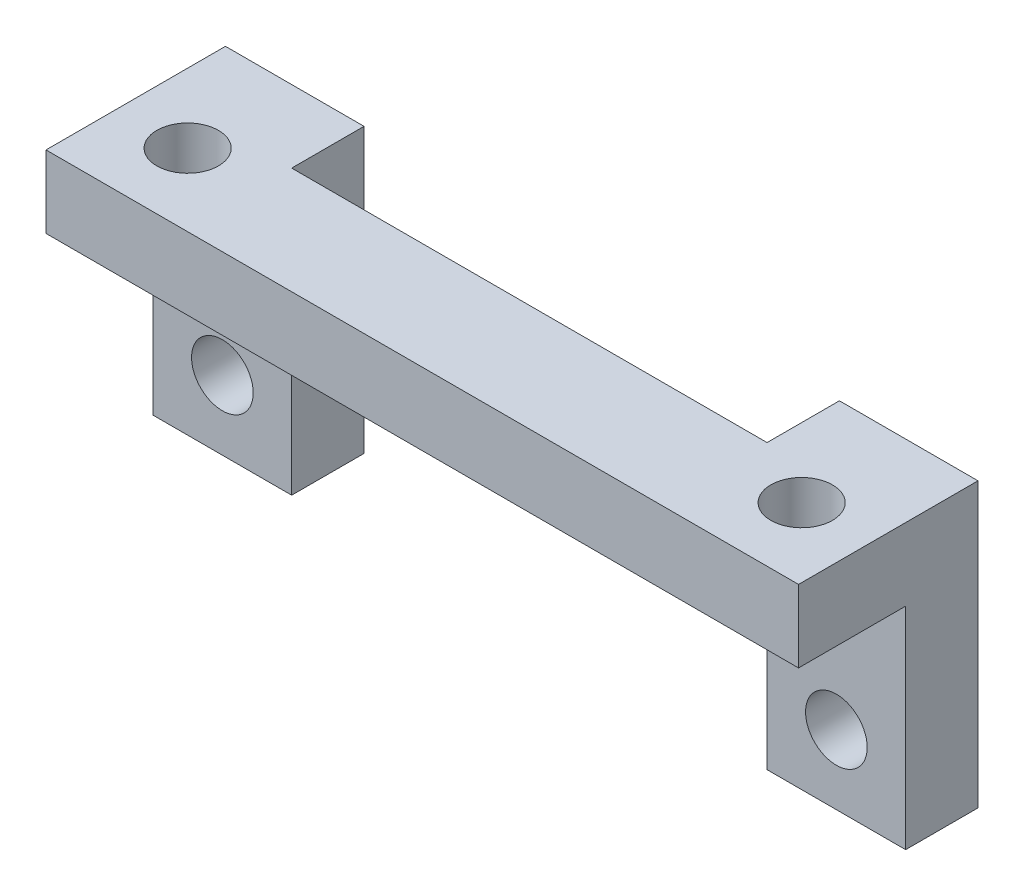
ISO-10303-21;
HEADER;
FILE_DESCRIPTION(('STEP AP214'),'2;1');
FILE_NAME('part.step','',(''),(''),'','','');
FILE_SCHEMA(('AUTOMOTIVE_DESIGN { 1 0 10303 214 1 1 1 1 }'));
ENDSEC;
DATA;
#1=APPLICATION_CONTEXT('core data for automotive mechanical design processes');
#2=APPLICATION_PROTOCOL_DEFINITION('international standard','automotive_design',2000,#1);
#3=PRODUCT_CONTEXT('',#1,'mechanical');
#4=PRODUCT('Part','Part','',(#3));
#5=PRODUCT_RELATED_PRODUCT_CATEGORY('part','',(#4));
#6=PRODUCT_DEFINITION_FORMATION('','',#4);
#7=PRODUCT_DEFINITION_CONTEXT('part definition',#1,'design');
#8=PRODUCT_DEFINITION('design','',#6,#7);
#9=PRODUCT_DEFINITION_SHAPE('','',#8);
#10=(LENGTH_UNIT() NAMED_UNIT(*) SI_UNIT(.MILLI.,.METRE.));
#11=(NAMED_UNIT(*) PLANE_ANGLE_UNIT() SI_UNIT($,.RADIAN.));
#12=(NAMED_UNIT(*) SI_UNIT($,.STERADIAN.) SOLID_ANGLE_UNIT());
#13=UNCERTAINTY_MEASURE_WITH_UNIT(LENGTH_MEASURE(1.E-05),#10,'distance_accuracy_value','');
#14=(GEOMETRIC_REPRESENTATION_CONTEXT(3) GLOBAL_UNCERTAINTY_ASSIGNED_CONTEXT((#13)) GLOBAL_UNIT_ASSIGNED_CONTEXT((#10,
#11,#12)) REPRESENTATION_CONTEXT('',''));
#15=CARTESIAN_POINT('',(0.,0.,0.));
#16=DIRECTION('',(0.,0.,1.));
#17=DIRECTION('',(1.,0.,0.));
#18=AXIS2_PLACEMENT_3D('',#15,#16,#17);
#19=CARTESIAN_POINT('',(13.4703798183963,-6.21538,-0.762000000000008));
#20=DIRECTION('',(0.,0.,1.));
#21=DIRECTION('',(1.,0.,0.));
#22=AXIS2_PLACEMENT_3D('',#19,#20,#21);
#23=CYLINDRICAL_SURFACE('',#22,1.35254999999999);
#24=CARTESIAN_POINT('',(13.4703798183963,-6.21538,-3.93700000000001));
#25=DIRECTION('',(0.,0.,1.));
#26=DIRECTION('',(1.,0.,0.));
#27=AXIS2_PLACEMENT_3D('',#24,#25,#26);
#28=CIRCLE('',#27,1.35254999999999);
#29=CARTESIAN_POINT('',(14.8229298183963,-6.21538,-3.93700000000001));
#30=VERTEX_POINT('',#29);
#31=EDGE_CURVE('E130',#30,#30,#28,.F.);
#32=ORIENTED_EDGE('',*,*,#31,.T.);
#33=EDGE_LOOP('',(#32));
#34=FACE_BOUND('',#33,.T.);
#35=CARTESIAN_POINT('',(13.4703798183963,-6.21538,-0.762000000000007));
#36=DIRECTION('',(0.,0.,1.));
#37=DIRECTION('',(1.,0.,0.));
#38=AXIS2_PLACEMENT_3D('',#35,#36,#37);
#39=CIRCLE('',#38,1.35254999999999);
#40=CARTESIAN_POINT('',(14.8229298183963,-6.21538,-0.762000000000007));
#41=VERTEX_POINT('',#40);
#42=EDGE_CURVE('E108',#41,#41,#39,.T.);
#43=ORIENTED_EDGE('',*,*,#42,.T.);
#44=EDGE_LOOP('',(#43));
#45=FACE_BOUND('',#44,.T.);
#46=ADVANCED_FACE('F17',(#34,#45),#23,.F.);
#47=CARTESIAN_POINT('',(-13.4703841816037,-6.21538,-0.762000000000008));
#48=DIRECTION('',(0.,0.,1.));
#49=DIRECTION('',(1.,0.,0.));
#50=AXIS2_PLACEMENT_3D('',#47,#48,#49);
#51=CYLINDRICAL_SURFACE('',#50,1.35254999999999);
#52=CARTESIAN_POINT('',(-13.4703841816037,-6.21538,-3.93700000000001));
#53=DIRECTION('',(0.,0.,1.));
#54=DIRECTION('',(1.,0.,0.));
#55=AXIS2_PLACEMENT_3D('',#52,#53,#54);
#56=CIRCLE('',#55,1.35254999999999);
#57=CARTESIAN_POINT('',(-12.1178341816037,-6.21538,-3.93700000000001));
#58=VERTEX_POINT('',#57);
#59=EDGE_CURVE('E145',#58,#58,#56,.F.);
#60=ORIENTED_EDGE('',*,*,#59,.T.);
#61=EDGE_LOOP('',(#60));
#62=FACE_BOUND('',#61,.T.);
#63=CARTESIAN_POINT('',(-13.4703841816037,-6.21538,-0.762000000000007));
#64=DIRECTION('',(0.,0.,1.));
#65=DIRECTION('',(1.,0.,0.));
#66=AXIS2_PLACEMENT_3D('',#63,#64,#65);
#67=CIRCLE('',#66,1.35254999999999);
#68=CARTESIAN_POINT('',(-12.1178341816037,-6.21538,-0.762000000000007));
#69=VERTEX_POINT('',#68);
#70=EDGE_CURVE('E20',#69,#69,#67,.T.);
#71=ORIENTED_EDGE('',*,*,#70,.T.);
#72=EDGE_LOOP('',(#71));
#73=FACE_BOUND('',#72,.T.);
#74=ADVANCED_FACE('F322',(#62,#73),#51,.F.);
#75=CARTESIAN_POINT('',(-10.42924,-9.25576,-0.762000000000008));
#76=DIRECTION('',(0.,0.,-1.));
#77=DIRECTION('',(-1.,0.,0.));
#78=AXIS2_PLACEMENT_3D('',#75,#76,#77);
#79=PLANE('',#78);
#80=DIRECTION('',(0.,1.,0.));
#81=VECTOR('',#80,1.);
#82=CARTESIAN_POINT('',(-16.51,3.175,-0.762000000000008));
#83=LINE('',#82,#81);
#84=CARTESIAN_POINT('',(-16.51,0.,-0.762000000000004));
#85=VERTEX_POINT('',#84);
#86=CARTESIAN_POINT('',(-16.51,-9.25576,-0.762000000000008));
#87=VERTEX_POINT('',#86);
#88=EDGE_CURVE('E356',#85,#87,#83,.F.);
#89=ORIENTED_EDGE('',*,*,#88,.T.);
#90=DIRECTION('',(1.,0.,0.));
#91=VECTOR('',#90,1.);
#92=CARTESIAN_POINT('',(0.,-9.25576,-0.762000000000008));
#93=LINE('',#92,#91);
#94=CARTESIAN_POINT('',(-10.42924,-9.25576,-0.762000000000008));
#95=VERTEX_POINT('',#94);
#96=EDGE_CURVE('E134',#95,#87,#93,.F.);
#97=ORIENTED_EDGE('',*,*,#96,.F.);
#98=DIRECTION('',(0.,1.,0.));
#99=VECTOR('',#98,1.);
#100=CARTESIAN_POINT('',(-10.42924,3.175,-0.762000000000008));
#101=LINE('',#100,#99);
#102=CARTESIAN_POINT('',(-10.42924,0.,-0.762000000000002));
#103=VERTEX_POINT('',#102);
#104=EDGE_CURVE('E381',#95,#103,#101,.T.);
#105=ORIENTED_EDGE('',*,*,#104,.T.);
#106=DIRECTION('',(1.,0.,0.));
#107=VECTOR('',#106,1.);
#108=CARTESIAN_POINT('',(0.,0.,-0.762000000000001));
#109=LINE('',#108,#107);
#110=EDGE_CURVE('E107',#103,#85,#109,.F.);
#111=ORIENTED_EDGE('',*,*,#110,.T.);
#112=EDGE_LOOP('',(#89,#97,#105,#111));
#113=FACE_BOUND('',#112,.T.);
#114=ORIENTED_EDGE('',*,*,#70,.F.);
#115=EDGE_LOOP('',(#114));
#116=FACE_BOUND('',#115,.T.);
#117=ADVANCED_FACE('F313',(#113,#116),#79,.F.);
#118=CARTESIAN_POINT('',(0.,-9.25576,0.));
#119=DIRECTION('',(0.,-1.,0.));
#120=DIRECTION('',(0.,0.,-1.));
#121=AXIS2_PLACEMENT_3D('',#118,#119,#120);
#122=PLANE('',#121);
#123=DIRECTION('',(0.,0.,-1.));
#124=VECTOR('',#123,1.);
#125=CARTESIAN_POINT('',(-16.51,-9.25576,3.937));
#126=LINE('',#125,#124);
#127=CARTESIAN_POINT('',(-16.51,-9.25576,-3.937));
#128=VERTEX_POINT('',#127);
#129=EDGE_CURVE('E361',#87,#128,#126,.T.);
#130=ORIENTED_EDGE('',*,*,#129,.T.);
#131=DIRECTION('',(1.,0.,0.));
#132=VECTOR('',#131,1.);
#133=CARTESIAN_POINT('',(-16.51,-9.25576,-3.937));
#134=LINE('',#133,#132);
#135=CARTESIAN_POINT('',(-10.42924,-9.25576,-3.937));
#136=VERTEX_POINT('',#135);
#137=EDGE_CURVE('E148',#128,#136,#134,.T.);
#138=ORIENTED_EDGE('',*,*,#137,.T.);
#139=DIRECTION('',(0.,0.,1.));
#140=VECTOR('',#139,1.);
#141=CARTESIAN_POINT('',(-10.42924,-9.25576,-3.937));
#142=LINE('',#141,#140);
#143=EDGE_CURVE('E366',#136,#95,#142,.T.);
#144=ORIENTED_EDGE('',*,*,#143,.T.);
#145=ORIENTED_EDGE('',*,*,#96,.T.);
#146=EDGE_LOOP('',(#130,#138,#144,#145));
#147=FACE_BOUND('',#146,.T.);
#148=ADVANCED_FACE('F170',(#147),#122,.T.);
#149=CARTESIAN_POINT('',(0.,-9.25576,0.));
#150=DIRECTION('',(0.,1.,0.));
#151=DIRECTION('',(0.,0.,1.));
#152=AXIS2_PLACEMENT_3D('',#149,#150,#151);
#153=PLANE('',#152);
#154=DIRECTION('',(0.,0.,-1.));
#155=VECTOR('',#154,1.);
#156=CARTESIAN_POINT('',(10.42924,-9.25576,-3.937));
#157=LINE('',#156,#155);
#158=CARTESIAN_POINT('',(10.42924,-9.25576,-0.762000000000004));
#159=VERTEX_POINT('',#158);
#160=CARTESIAN_POINT('',(10.42924,-9.25576,-3.937));
#161=VERTEX_POINT('',#160);
#162=EDGE_CURVE('E97',#159,#161,#157,.T.);
#163=ORIENTED_EDGE('',*,*,#162,.T.);
#164=DIRECTION('',(1.,0.,0.));
#165=VECTOR('',#164,1.);
#166=CARTESIAN_POINT('',(10.42924,-9.25576,-3.937));
#167=LINE('',#166,#165);
#168=CARTESIAN_POINT('',(16.51,-9.25576,-3.937));
#169=VERTEX_POINT('',#168);
#170=EDGE_CURVE('E118',#161,#169,#167,.T.);
#171=ORIENTED_EDGE('',*,*,#170,.T.);
#172=DIRECTION('',(0.,0.,1.));
#173=VECTOR('',#172,1.);
#174=CARTESIAN_POINT('',(16.51,-9.25576,3.937));
#175=LINE('',#174,#173);
#176=CARTESIAN_POINT('',(16.51,-9.25576,-0.762000000000004));
#177=VERTEX_POINT('',#176);
#178=EDGE_CURVE('E104',#169,#177,#175,.T.);
#179=ORIENTED_EDGE('',*,*,#178,.T.);
#180=DIRECTION('',(-1.,0.,0.));
#181=VECTOR('',#180,1.);
#182=CARTESIAN_POINT('',(10.42924,-9.25576,-0.762000000000004));
#183=LINE('',#182,#181);
#184=EDGE_CURVE('E100',#177,#159,#183,.T.);
#185=ORIENTED_EDGE('',*,*,#184,.T.);
#186=EDGE_LOOP('',(#163,#171,#179,#185));
#187=FACE_BOUND('',#186,.T.);
#188=ADVANCED_FACE('F102',(#187),#153,.F.);
#189=CARTESIAN_POINT('',(10.42924,-9.25576,-0.762000000000004));
#190=DIRECTION('',(0.,0.,-1.));
#191=DIRECTION('',(-1.,0.,0.));
#192=AXIS2_PLACEMENT_3D('',#189,#190,#191);
#193=PLANE('',#192);
#194=DIRECTION('',(0.,1.,0.));
#195=VECTOR('',#194,1.);
#196=CARTESIAN_POINT('',(10.42924,3.175,-0.762000000000004));
#197=LINE('',#196,#195);
#198=CARTESIAN_POINT('',(10.42924,0.,-0.762000000000004));
#199=VERTEX_POINT('',#198);
#200=EDGE_CURVE('E111',#199,#159,#197,.F.);
#201=ORIENTED_EDGE('',*,*,#200,.T.);
#202=ORIENTED_EDGE('',*,*,#184,.F.);
#203=DIRECTION('',(0.,1.,0.));
#204=VECTOR('',#203,1.);
#205=CARTESIAN_POINT('',(16.51,3.175,-0.762000000000003));
#206=LINE('',#205,#204);
#207=CARTESIAN_POINT('',(16.51,0.,-0.762000000000003));
#208=VERTEX_POINT('',#207);
#209=EDGE_CURVE('E404',#177,#208,#206,.T.);
#210=ORIENTED_EDGE('',*,*,#209,.T.);
#211=DIRECTION('',(1.,0.,0.));
#212=VECTOR('',#211,1.);
#213=CARTESIAN_POINT('',(0.,0.,-0.762000000000003));
#214=LINE('',#213,#212);
#215=EDGE_CURVE('E115',#208,#199,#214,.F.);
#216=ORIENTED_EDGE('',*,*,#215,.T.);
#217=EDGE_LOOP('',(#201,#202,#210,#216));
#218=FACE_BOUND('',#217,.T.);
#219=ORIENTED_EDGE('',*,*,#42,.F.);
#220=EDGE_LOOP('',(#219));
#221=FACE_BOUND('',#220,.T.);
#222=ADVANCED_FACE('F112',(#218,#221),#193,.F.);
#223=CARTESIAN_POINT('',(0.,0.,0.));
#224=DIRECTION('',(0.,1.,0.));
#225=DIRECTION('',(0.,0.,1.));
#226=AXIS2_PLACEMENT_3D('',#223,#224,#225);
#227=PLANE('',#226);
#228=DIRECTION('',(0.,0.,1.));
#229=VECTOR('',#228,1.);
#230=CARTESIAN_POINT('',(16.51,0.,3.937));
#231=LINE('',#230,#229);
#232=CARTESIAN_POINT('',(16.51,0.,3.937));
#233=VERTEX_POINT('',#232);
#234=EDGE_CURVE('E144',#208,#233,#231,.T.);
#235=ORIENTED_EDGE('',*,*,#234,.T.);
#236=DIRECTION('',(-1.,0.,0.));
#237=VECTOR('',#236,1.);
#238=CARTESIAN_POINT('',(-16.51,0.,3.937));
#239=LINE('',#238,#237);
#240=CARTESIAN_POINT('',(-16.51,0.,3.937));
#241=VERTEX_POINT('',#240);
#242=EDGE_CURVE('E411',#233,#241,#239,.T.);
#243=ORIENTED_EDGE('',*,*,#242,.T.);
#244=DIRECTION('',(0.,0.,-1.));
#245=VECTOR('',#244,1.);
#246=CARTESIAN_POINT('',(-16.51,0.,3.937));
#247=LINE('',#246,#245);
#248=EDGE_CURVE('E362',#241,#85,#247,.T.);
#249=ORIENTED_EDGE('',*,*,#248,.T.);
#250=ORIENTED_EDGE('',*,*,#110,.F.);
#251=DIRECTION('',(1.,0.,0.));
#252=VECTOR('',#251,1.);
#253=CARTESIAN_POINT('',(-10.42924,0.,-0.762000000000001));
#254=LINE('',#253,#252);
#255=EDGE_CURVE('E384',#103,#199,#254,.T.);
#256=ORIENTED_EDGE('',*,*,#255,.T.);
#257=ORIENTED_EDGE('',*,*,#215,.F.);
#258=EDGE_LOOP('',(#235,#243,#249,#250,#256,#257));
#259=FACE_BOUND('',#258,.T.);
#260=CARTESIAN_POINT('',(13.4703841816037,0.,0.761999999999996));
#261=DIRECTION('',(0.,1.,0.));
#262=DIRECTION('',(0.,0.,1.));
#263=AXIS2_PLACEMENT_3D('',#260,#261,#262);
#264=CIRCLE('',#263,1.35254999999999);
#265=CARTESIAN_POINT('',(13.4703841816037,0.,2.11454999999999));
#266=VERTEX_POINT('',#265);
#267=EDGE_CURVE('E152',#266,#266,#264,.T.);
#268=ORIENTED_EDGE('',*,*,#267,.T.);
#269=EDGE_LOOP('',(#268));
#270=FACE_BOUND('',#269,.T.);
#271=CARTESIAN_POINT('',(-13.4703841816037,0.,0.762));
#272=DIRECTION('',(0.,1.,0.));
#273=DIRECTION('',(0.,0.,1.));
#274=AXIS2_PLACEMENT_3D('',#271,#272,#273);
#275=CIRCLE('',#274,1.35254999999999);
#276=CARTESIAN_POINT('',(-13.4703841816037,0.,2.11454999999999));
#277=VERTEX_POINT('',#276);
#278=EDGE_CURVE('E132',#277,#277,#275,.T.);
#279=ORIENTED_EDGE('',*,*,#278,.T.);
#280=EDGE_LOOP('',(#279));
#281=FACE_BOUND('',#280,.T.);
#282=ADVANCED_FACE('F160',(#259,#270,#281),#227,.F.);
#283=CARTESIAN_POINT('',(-13.4703841816037,3.175,0.762));
#284=DIRECTION('',(0.,1.,0.));
#285=DIRECTION('',(0.,0.,1.));
#286=AXIS2_PLACEMENT_3D('',#283,#284,#285);
#287=CYLINDRICAL_SURFACE('',#286,1.35254999999999);
#288=CARTESIAN_POINT('',(-13.4703841816037,3.175,0.762));
#289=DIRECTION('',(0.,1.,0.));
#290=DIRECTION('',(0.,0.,1.));
#291=AXIS2_PLACEMENT_3D('',#288,#289,#290);
#292=CIRCLE('',#291,1.35254999999999);
#293=CARTESIAN_POINT('',(-13.4703841816037,3.175,2.11454999999999));
#294=VERTEX_POINT('',#293);
#295=EDGE_CURVE('E141',#294,#294,#292,.F.);
#296=ORIENTED_EDGE('',*,*,#295,.F.);
#297=EDGE_LOOP('',(#296));
#298=FACE_BOUND('',#297,.T.);
#299=ORIENTED_EDGE('',*,*,#278,.F.);
#300=EDGE_LOOP('',(#299));
#301=FACE_BOUND('',#300,.T.);
#302=ADVANCED_FACE('F167',(#298,#301),#287,.F.);
#303=CARTESIAN_POINT('',(13.4703841816037,3.175,0.761999999999996));
#304=DIRECTION('',(0.,1.,0.));
#305=DIRECTION('',(0.,0.,1.));
#306=AXIS2_PLACEMENT_3D('',#303,#304,#305);
#307=CYLINDRICAL_SURFACE('',#306,1.35254999999999);
#308=CARTESIAN_POINT('',(13.4703841816037,3.175,0.761999999999996));
#309=DIRECTION('',(0.,1.,0.));
#310=DIRECTION('',(0.,0.,1.));
#311=AXIS2_PLACEMENT_3D('',#308,#309,#310);
#312=CIRCLE('',#311,1.35254999999999);
#313=CARTESIAN_POINT('',(13.4703841816037,3.175,2.11454999999999));
#314=VERTEX_POINT('',#313);
#315=EDGE_CURVE('E137',#314,#314,#312,.F.);
#316=ORIENTED_EDGE('',*,*,#315,.F.);
#317=EDGE_LOOP('',(#316));
#318=FACE_BOUND('',#317,.T.);
#319=ORIENTED_EDGE('',*,*,#267,.F.);
#320=EDGE_LOOP('',(#319));
#321=FACE_BOUND('',#320,.T.);
#322=ADVANCED_FACE('F209',(#318,#321),#307,.F.);
#323=CARTESIAN_POINT('',(10.42924,3.175,-3.937));
#324=DIRECTION('',(0.,0.,1.));
#325=DIRECTION('',(1.,0.,0.));
#326=AXIS2_PLACEMENT_3D('',#323,#324,#325);
#327=PLANE('',#326);
#328=ORIENTED_EDGE('',*,*,#170,.F.);
#329=DIRECTION('',(0.,1.,0.));
#330=VECTOR('',#329,1.);
#331=CARTESIAN_POINT('',(10.42924,3.175,-3.937));
#332=LINE('',#331,#330);
#333=CARTESIAN_POINT('',(10.42924,3.175,-3.937));
#334=VERTEX_POINT('',#333);
#335=EDGE_CURVE('E123',#161,#334,#332,.T.);
#336=ORIENTED_EDGE('',*,*,#335,.T.);
#337=DIRECTION('',(1.,0.,0.));
#338=VECTOR('',#337,1.);
#339=CARTESIAN_POINT('',(0.,3.175,-3.937));
#340=LINE('',#339,#338);
#341=CARTESIAN_POINT('',(16.51,3.175,-3.937));
#342=VERTEX_POINT('',#341);
#343=EDGE_CURVE('E140',#342,#334,#340,.F.);
#344=ORIENTED_EDGE('',*,*,#343,.F.);
#345=DIRECTION('',(0.,1.,0.));
#346=VECTOR('',#345,1.);
#347=CARTESIAN_POINT('',(16.51,3.175,-3.937));
#348=LINE('',#347,#346);
#349=EDGE_CURVE('E407',#342,#169,#348,.F.);
#350=ORIENTED_EDGE('',*,*,#349,.T.);
#351=EDGE_LOOP('',(#328,#336,#344,#350));
#352=FACE_BOUND('',#351,.T.);
#353=ORIENTED_EDGE('',*,*,#31,.F.);
#354=EDGE_LOOP('',(#353));
#355=FACE_BOUND('',#354,.T.);
#356=ADVANCED_FACE('F206',(#352,#355),#327,.F.);
#357=CARTESIAN_POINT('',(10.42924,3.175,-3.937));
#358=DIRECTION('',(1.,0.,0.));
#359=DIRECTION('',(0.,0.,-1.));
#360=AXIS2_PLACEMENT_3D('',#357,#358,#359);
#361=PLANE('',#360);
#362=ORIENTED_EDGE('',*,*,#162,.F.);
#363=ORIENTED_EDGE('',*,*,#200,.F.);
#364=DIRECTION('',(0.,1.,0.));
#365=VECTOR('',#364,1.);
#366=CARTESIAN_POINT('',(10.42924,3.175,-0.762000000000004));
#367=LINE('',#366,#365);
#368=CARTESIAN_POINT('',(10.42924,3.175,-0.762000000000004));
#369=VERTEX_POINT('',#368);
#370=EDGE_CURVE('E125',#199,#369,#367,.T.);
#371=ORIENTED_EDGE('',*,*,#370,.T.);
#372=DIRECTION('',(0.,0.,1.));
#373=VECTOR('',#372,1.);
#374=CARTESIAN_POINT('',(10.42924,3.175,0.));
#375=LINE('',#374,#373);
#376=EDGE_CURVE('E388',#334,#369,#375,.T.);
#377=ORIENTED_EDGE('',*,*,#376,.F.);
#378=ORIENTED_EDGE('',*,*,#335,.F.);
#379=EDGE_LOOP('',(#362,#363,#371,#377,#378));
#380=FACE_BOUND('',#379,.T.);
#381=ADVANCED_FACE('F121',(#380),#361,.F.);
#382=CARTESIAN_POINT('',(-10.42924,3.175,-0.762000000000001));
#383=DIRECTION('',(0.,0.,1.));
#384=DIRECTION('',(1.,0.,0.));
#385=AXIS2_PLACEMENT_3D('',#382,#383,#384);
#386=PLANE('',#385);
#387=DIRECTION('',(0.,1.,0.));
#388=VECTOR('',#387,1.);
#389=CARTESIAN_POINT('',(-10.42924,3.175,-0.762000000000001));
#390=LINE('',#389,#388);
#391=CARTESIAN_POINT('',(-10.42924,3.175,-0.762000000000001));
#392=VERTEX_POINT('',#391);
#393=EDGE_CURVE('E149',#103,#392,#390,.T.);
#394=ORIENTED_EDGE('',*,*,#393,.T.);
#395=DIRECTION('',(1.,0.,0.));
#396=VECTOR('',#395,1.);
#397=CARTESIAN_POINT('',(0.,3.175,-0.762000000000004));
#398=LINE('',#397,#396);
#399=EDGE_CURVE('E392',#369,#392,#398,.F.);
#400=ORIENTED_EDGE('',*,*,#399,.F.);
#401=ORIENTED_EDGE('',*,*,#370,.F.);
#402=ORIENTED_EDGE('',*,*,#255,.F.);
#403=EDGE_LOOP('',(#394,#400,#401,#402));
#404=FACE_BOUND('',#403,.T.);
#405=ADVANCED_FACE('F199',(#404),#386,.F.);
#406=CARTESIAN_POINT('',(-10.42924,3.175,-3.937));
#407=DIRECTION('',(-1.,0.,0.));
#408=DIRECTION('',(0.,0.,1.));
#409=AXIS2_PLACEMENT_3D('',#406,#407,#408);
#410=PLANE('',#409);
#411=ORIENTED_EDGE('',*,*,#104,.F.);
#412=ORIENTED_EDGE('',*,*,#143,.F.);
#413=DIRECTION('',(0.,1.,0.));
#414=VECTOR('',#413,1.);
#415=CARTESIAN_POINT('',(-10.42924,3.175,-3.937));
#416=LINE('',#415,#414);
#417=CARTESIAN_POINT('',(-10.42924,3.175,-3.937));
#418=VERTEX_POINT('',#417);
#419=EDGE_CURVE('E377',#136,#418,#416,.T.);
#420=ORIENTED_EDGE('',*,*,#419,.T.);
#421=DIRECTION('',(0.,0.,1.));
#422=VECTOR('',#421,1.);
#423=CARTESIAN_POINT('',(-10.42924,3.175,0.));
#424=LINE('',#423,#422);
#425=EDGE_CURVE('E396',#392,#418,#424,.F.);
#426=ORIENTED_EDGE('',*,*,#425,.F.);
#427=ORIENTED_EDGE('',*,*,#393,.F.);
#428=EDGE_LOOP('',(#411,#412,#420,#426,#427));
#429=FACE_BOUND('',#428,.T.);
#430=ADVANCED_FACE('F195',(#429),#410,.F.);
#431=CARTESIAN_POINT('',(-16.51,3.175,-3.937));
#432=DIRECTION('',(0.,0.,1.));
#433=DIRECTION('',(1.,0.,0.));
#434=AXIS2_PLACEMENT_3D('',#431,#432,#433);
#435=PLANE('',#434);
#436=ORIENTED_EDGE('',*,*,#137,.F.);
#437=DIRECTION('',(0.,1.,0.));
#438=VECTOR('',#437,1.);
#439=CARTESIAN_POINT('',(-16.51,3.175,-3.937));
#440=LINE('',#439,#438);
#441=CARTESIAN_POINT('',(-16.51,3.175,-3.937));
#442=VERTEX_POINT('',#441);
#443=EDGE_CURVE('E370',#128,#442,#440,.T.);
#444=ORIENTED_EDGE('',*,*,#443,.T.);
#445=DIRECTION('',(1.,0.,0.));
#446=VECTOR('',#445,1.);
#447=CARTESIAN_POINT('',(0.,3.175,-3.937));
#448=LINE('',#447,#446);
#449=EDGE_CURVE('E419',#418,#442,#448,.F.);
#450=ORIENTED_EDGE('',*,*,#449,.F.);
#451=ORIENTED_EDGE('',*,*,#419,.F.);
#452=EDGE_LOOP('',(#436,#444,#450,#451));
#453=FACE_BOUND('',#452,.T.);
#454=ORIENTED_EDGE('',*,*,#59,.F.);
#455=EDGE_LOOP('',(#454));
#456=FACE_BOUND('',#455,.T.);
#457=ADVANCED_FACE('F191',(#453,#456),#435,.F.);
#458=CARTESIAN_POINT('',(-16.51,3.175,3.937));
#459=DIRECTION('',(1.,0.,0.));
#460=DIRECTION('',(0.,0.,-1.));
#461=AXIS2_PLACEMENT_3D('',#458,#459,#460);
#462=PLANE('',#461);
#463=ORIENTED_EDGE('',*,*,#129,.F.);
#464=ORIENTED_EDGE('',*,*,#88,.F.);
#465=ORIENTED_EDGE('',*,*,#248,.F.);
#466=DIRECTION('',(0.,1.,0.));
#467=VECTOR('',#466,1.);
#468=CARTESIAN_POINT('',(-16.51,3.175,3.937));
#469=LINE('',#468,#467);
#470=CARTESIAN_POINT('',(-16.51,3.175,3.937));
#471=VERTEX_POINT('',#470);
#472=EDGE_CURVE('E372',#241,#471,#469,.T.);
#473=ORIENTED_EDGE('',*,*,#472,.T.);
#474=DIRECTION('',(0.,0.,1.));
#475=VECTOR('',#474,1.);
#476=CARTESIAN_POINT('',(-16.51,3.175,0.));
#477=LINE('',#476,#475);
#478=EDGE_CURVE('E415',#442,#471,#477,.T.);
#479=ORIENTED_EDGE('',*,*,#478,.F.);
#480=ORIENTED_EDGE('',*,*,#443,.F.);
#481=EDGE_LOOP('',(#463,#464,#465,#473,#479,#480));
#482=FACE_BOUND('',#481,.T.);
#483=ADVANCED_FACE('F188',(#482),#462,.F.);
#484=CARTESIAN_POINT('',(-16.51,3.175,3.937));
#485=DIRECTION('',(0.,0.,-1.));
#486=DIRECTION('',(-1.,0.,0.));
#487=AXIS2_PLACEMENT_3D('',#484,#485,#486);
#488=PLANE('',#487);
#489=DIRECTION('',(0.,1.,0.));
#490=VECTOR('',#489,1.);
#491=CARTESIAN_POINT('',(16.51,3.175,3.937));
#492=LINE('',#491,#490);
#493=CARTESIAN_POINT('',(16.51,3.175,3.937));
#494=VERTEX_POINT('',#493);
#495=EDGE_CURVE('E35',#233,#494,#492,.T.);
#496=ORIENTED_EDGE('',*,*,#495,.T.);
#497=DIRECTION('',(1.,0.,0.));
#498=VECTOR('',#497,1.);
#499=CARTESIAN_POINT('',(0.,3.175,3.937));
#500=LINE('',#499,#498);
#501=EDGE_CURVE('E26',#471,#494,#500,.T.);
#502=ORIENTED_EDGE('',*,*,#501,.F.);
#503=ORIENTED_EDGE('',*,*,#472,.F.);
#504=ORIENTED_EDGE('',*,*,#242,.F.);
#505=EDGE_LOOP('',(#496,#502,#503,#504));
#506=FACE_BOUND('',#505,.T.);
#507=ADVANCED_FACE('F180',(#506),#488,.F.);
#508=CARTESIAN_POINT('',(16.51,3.175,3.937));
#509=DIRECTION('',(-1.,0.,0.));
#510=DIRECTION('',(0.,0.,1.));
#511=AXIS2_PLACEMENT_3D('',#508,#509,#510);
#512=PLANE('',#511);
#513=ORIENTED_EDGE('',*,*,#209,.F.);
#514=ORIENTED_EDGE('',*,*,#178,.F.);
#515=ORIENTED_EDGE('',*,*,#349,.F.);
#516=DIRECTION('',(0.,0.,1.));
#517=VECTOR('',#516,1.);
#518=CARTESIAN_POINT('',(16.51,3.175,0.));
#519=LINE('',#518,#517);
#520=EDGE_CURVE('E10',#494,#342,#519,.F.);
#521=ORIENTED_EDGE('',*,*,#520,.F.);
#522=ORIENTED_EDGE('',*,*,#495,.F.);
#523=ORIENTED_EDGE('',*,*,#234,.F.);
#524=EDGE_LOOP('',(#513,#514,#515,#521,#522,#523));
#525=FACE_BOUND('',#524,.T.);
#526=ADVANCED_FACE('F174',(#525),#512,.F.);
#527=CARTESIAN_POINT('',(0.,3.175,0.));
#528=DIRECTION('',(0.,1.,0.));
#529=DIRECTION('',(0.,0.,1.));
#530=AXIS2_PLACEMENT_3D('',#527,#528,#529);
#531=PLANE('',#530);
#532=ORIENTED_EDGE('',*,*,#501,.T.);
#533=ORIENTED_EDGE('',*,*,#520,.T.);
#534=ORIENTED_EDGE('',*,*,#343,.T.);
#535=ORIENTED_EDGE('',*,*,#376,.T.);
#536=ORIENTED_EDGE('',*,*,#399,.T.);
#537=ORIENTED_EDGE('',*,*,#425,.T.);
#538=ORIENTED_EDGE('',*,*,#449,.T.);
#539=ORIENTED_EDGE('',*,*,#478,.T.);
#540=EDGE_LOOP('',(#532,#533,#534,#535,#536,#537,#538,#539));
#541=FACE_BOUND('',#540,.T.);
#542=ORIENTED_EDGE('',*,*,#315,.T.);
#543=EDGE_LOOP('',(#542));
#544=FACE_BOUND('',#543,.T.);
#545=ORIENTED_EDGE('',*,*,#295,.T.);
#546=EDGE_LOOP('',(#545));
#547=FACE_BOUND('',#546,.T.);
#548=ADVANCED_FACE('F172',(#541,#544,#547),#531,.T.);
#549=CLOSED_SHELL('',(#46,#74,#117,#148,#188,#222,#282,#302,#322,#356,#381,#405,#430,#457,#483,
#507,#526,#548));
#550=MANIFOLD_SOLID_BREP('B1',#549);
#551=ADVANCED_BREP_SHAPE_REPRESENTATION('',(#18,#550),#14);
#552=SHAPE_DEFINITION_REPRESENTATION(#9,#551);
ENDSEC;
END-ISO-10303-21;
